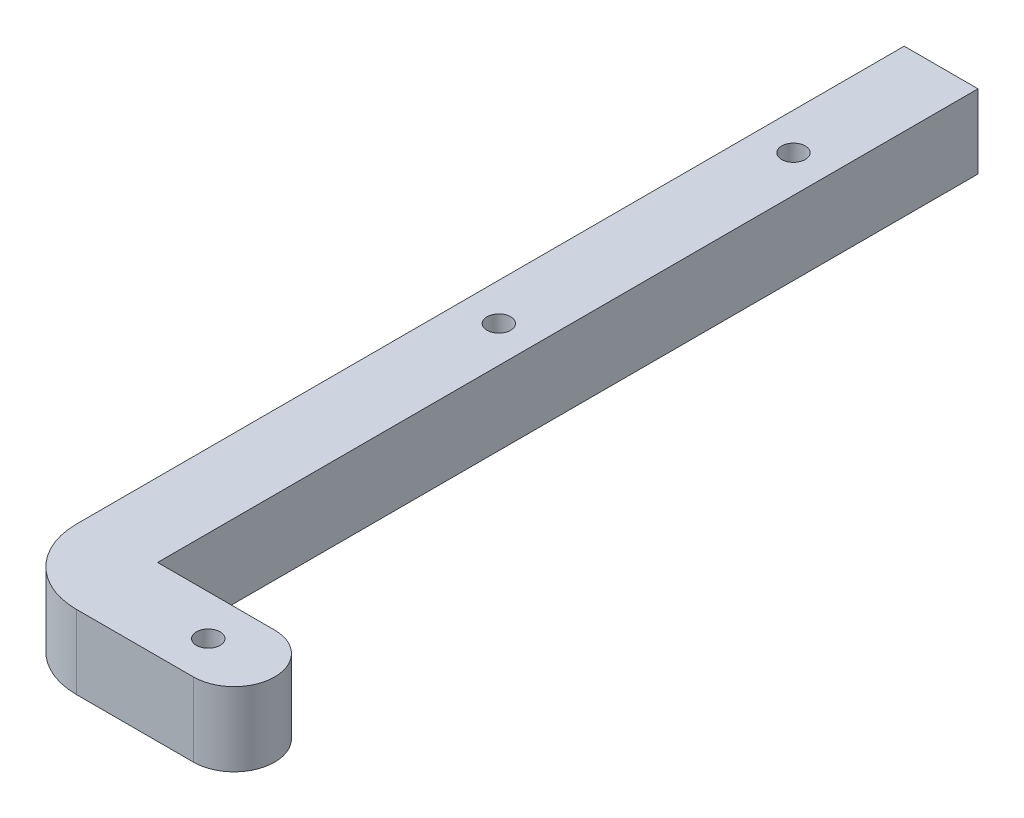
ISO-10303-21;
HEADER;
FILE_DESCRIPTION(('STEP AP214'),'2;1');
FILE_NAME('part.step','',(''),(''),'','','');
FILE_SCHEMA(('AUTOMOTIVE_DESIGN { 1 0 10303 214 1 1 1 1 }'));
ENDSEC;
DATA;
#1=APPLICATION_CONTEXT('core data for automotive mechanical design processes');
#2=APPLICATION_PROTOCOL_DEFINITION('international standard','automotive_design',2000,#1);
#3=PRODUCT_CONTEXT('',#1,'mechanical');
#4=PRODUCT('Part','Part','',(#3));
#5=PRODUCT_RELATED_PRODUCT_CATEGORY('part','',(#4));
#6=PRODUCT_DEFINITION_FORMATION('','',#4);
#7=PRODUCT_DEFINITION_CONTEXT('part definition',#1,'design');
#8=PRODUCT_DEFINITION('design','',#6,#7);
#9=PRODUCT_DEFINITION_SHAPE('','',#8);
#10=(LENGTH_UNIT() NAMED_UNIT(*) SI_UNIT(.MILLI.,.METRE.));
#11=(NAMED_UNIT(*) PLANE_ANGLE_UNIT() SI_UNIT($,.RADIAN.));
#12=(NAMED_UNIT(*) SI_UNIT($,.STERADIAN.) SOLID_ANGLE_UNIT());
#13=UNCERTAINTY_MEASURE_WITH_UNIT(LENGTH_MEASURE(1.E-05),#10,'distance_accuracy_value','');
#14=(GEOMETRIC_REPRESENTATION_CONTEXT(3) GLOBAL_UNCERTAINTY_ASSIGNED_CONTEXT((#13)) GLOBAL_UNIT_ASSIGNED_CONTEXT((#10,
#11,#12)) REPRESENTATION_CONTEXT('',''));
#15=CARTESIAN_POINT('',(0.,0.,0.));
#16=DIRECTION('',(0.,0.,1.));
#17=DIRECTION('',(1.,0.,0.));
#18=AXIS2_PLACEMENT_3D('',#15,#16,#17);
#19=CARTESIAN_POINT('',(-58.1403577183255,10.,6.78590490324844));
#20=DIRECTION('',(1.,0.,0.));
#21=DIRECTION('',(0.,0.,-1.));
#22=AXIS2_PLACEMENT_3D('',#19,#20,#21);
#23=PLANE('',#22);
#24=DIRECTION('',(0.,0.,1.));
#25=VECTOR('',#24,1.);
#26=CARTESIAN_POINT('',(-58.1403577183255,0.,6.78590490324844));
#27=LINE('',#26,#25);
#28=CARTESIAN_POINT('',(-58.1403577183256,0.,-104.367316492916));
#29=VERTEX_POINT('',#28);
#30=CARTESIAN_POINT('',(-58.1403577183255,0.,7.78590490324844));
#31=VERTEX_POINT('',#30);
#32=EDGE_CURVE('E137',#29,#31,#27,.T.);
#33=ORIENTED_EDGE('',*,*,#32,.T.);
#34=DIRECTION('',(0.,-1.,0.));
#35=VECTOR('',#34,1.);
#36=CARTESIAN_POINT('',(-58.1403577183255,10.,7.78590490324844));
#37=LINE('',#36,#35);
#38=CARTESIAN_POINT('',(-58.1403577183255,10.,7.78590490324842));
#39=VERTEX_POINT('',#38);
#40=EDGE_CURVE('E48',#31,#39,#37,.F.);
#41=ORIENTED_EDGE('',*,*,#40,.T.);
#42=DIRECTION('',(0.,0.,1.));
#43=VECTOR('',#42,1.);
#44=CARTESIAN_POINT('',(-58.1403577183256,10.,-104.367316492916));
#45=LINE('',#44,#43);
#46=CARTESIAN_POINT('',(-58.1403577183256,10.,-104.367316492916));
#47=VERTEX_POINT('',#46);
#48=EDGE_CURVE('E108',#47,#39,#45,.T.);
#49=ORIENTED_EDGE('',*,*,#48,.F.);
#50=DIRECTION('',(0.,-1.,0.));
#51=VECTOR('',#50,1.);
#52=CARTESIAN_POINT('',(-58.1403577183256,10.,-104.367316492916));
#53=LINE('',#52,#51);
#54=EDGE_CURVE('E136',#47,#29,#53,.T.);
#55=ORIENTED_EDGE('',*,*,#54,.T.);
#56=EDGE_LOOP('',(#33,#41,#49,#55));
#57=FACE_BOUND('',#56,.T.);
#58=ADVANCED_FACE('F39',(#57),#23,.F.);
#59=CARTESIAN_POINT('',(-58.1403577183255,10.,17.7859049032484));
#60=DIRECTION('',(0.,0.,-1.));
#61=DIRECTION('',(-1.,0.,0.));
#62=AXIS2_PLACEMENT_3D('',#59,#60,#61);
#63=PLANE('',#62);
#64=DIRECTION('',(1.,0.,0.));
#65=VECTOR('',#64,1.);
#66=CARTESIAN_POINT('',(-58.1403577183255,10.,17.7859049032484));
#67=LINE('',#66,#65);
#68=CARTESIAN_POINT('',(-48.1403577183255,10.,17.7859049032484));
#69=VERTEX_POINT('',#68);
#70=CARTESIAN_POINT('',(-32.2755837842111,10.,17.7859049032484));
#71=VERTEX_POINT('',#70);
#72=EDGE_CURVE('E97',#69,#71,#67,.T.);
#73=ORIENTED_EDGE('',*,*,#72,.F.);
#74=DIRECTION('',(0.,-1.,0.));
#75=VECTOR('',#74,1.);
#76=CARTESIAN_POINT('',(-48.1403577183255,10.,17.7859049032484));
#77=LINE('',#76,#75);
#78=CARTESIAN_POINT('',(-48.1403577183255,0.,17.7859049032484));
#79=VERTEX_POINT('',#78);
#80=EDGE_CURVE('E117',#69,#79,#77,.T.);
#81=ORIENTED_EDGE('',*,*,#80,.T.);
#82=DIRECTION('',(1.,0.,0.));
#83=VECTOR('',#82,1.);
#84=CARTESIAN_POINT('',(-58.1403577183255,0.,17.7859049032484));
#85=LINE('',#84,#83);
#86=CARTESIAN_POINT('',(-32.2755837842111,0.,17.7859049032484));
#87=VERTEX_POINT('',#86);
#88=EDGE_CURVE('E113',#79,#87,#85,.T.);
#89=ORIENTED_EDGE('',*,*,#88,.T.);
#90=DIRECTION('',(0.,-1.,0.));
#91=VECTOR('',#90,1.);
#92=CARTESIAN_POINT('',(-32.2755837842111,10.,17.7859049032484));
#93=LINE('',#92,#91);
#94=EDGE_CURVE('E111',#71,#87,#93,.T.);
#95=ORIENTED_EDGE('',*,*,#94,.F.);
#96=EDGE_LOOP('',(#73,#81,#89,#95));
#97=FACE_BOUND('',#96,.T.);
#98=ADVANCED_FACE('F112',(#97),#63,.F.);
#99=CARTESIAN_POINT('',(-32.2755837842111,10.,12.2859049032484));
#100=DIRECTION('',(0.,-1.,0.));
#101=DIRECTION('',(0.,0.,-1.));
#102=AXIS2_PLACEMENT_3D('',#99,#100,#101);
#103=CYLINDRICAL_SURFACE('',#102,5.5);
#104=CARTESIAN_POINT('',(-32.2755837842111,0.,12.2859049032484));
#105=DIRECTION('',(0.,1.,0.));
#106=DIRECTION('',(0.,0.,1.));
#107=AXIS2_PLACEMENT_3D('',#104,#105,#106);
#108=CIRCLE('',#107,5.5);
#109=CARTESIAN_POINT('',(-32.2755837842111,0.,6.78590490324844));
#110=VERTEX_POINT('',#109);
#111=EDGE_CURVE('E143',#87,#110,#108,.T.);
#112=ORIENTED_EDGE('',*,*,#111,.T.);
#113=DIRECTION('',(0.,-1.,0.));
#114=VECTOR('',#113,1.);
#115=CARTESIAN_POINT('',(-32.2755837842111,10.,6.78590490324844));
#116=LINE('',#115,#114);
#117=CARTESIAN_POINT('',(-32.2755837842111,10.,6.78590490324844));
#118=VERTEX_POINT('',#117);
#119=EDGE_CURVE('E118',#118,#110,#116,.T.);
#120=ORIENTED_EDGE('',*,*,#119,.F.);
#121=CARTESIAN_POINT('',(-32.2755837842111,10.,12.2859049032484));
#122=DIRECTION('',(0.,1.,0.));
#123=DIRECTION('',(0.,0.,1.));
#124=AXIS2_PLACEMENT_3D('',#121,#122,#123);
#125=CIRCLE('',#124,5.5);
#126=EDGE_CURVE('E101',#71,#118,#125,.T.);
#127=ORIENTED_EDGE('',*,*,#126,.F.);
#128=ORIENTED_EDGE('',*,*,#94,.T.);
#129=EDGE_LOOP('',(#112,#120,#127,#128));
#130=FACE_BOUND('',#129,.T.);
#131=ADVANCED_FACE('F120',(#130),#103,.T.);
#132=CARTESIAN_POINT('',(-48.1403577183255,10.,6.78590490324844));
#133=DIRECTION('',(0.,0.,1.));
#134=DIRECTION('',(1.,0.,0.));
#135=AXIS2_PLACEMENT_3D('',#132,#133,#134);
#136=PLANE('',#135);
#137=DIRECTION('',(-1.,0.,0.));
#138=VECTOR('',#137,1.);
#139=CARTESIAN_POINT('',(-48.1403577183255,0.,6.78590490324844));
#140=LINE('',#139,#138);
#141=CARTESIAN_POINT('',(-48.1403577183255,0.,6.78590490324844));
#142=VERTEX_POINT('',#141);
#143=EDGE_CURVE('E146',#110,#142,#140,.T.);
#144=ORIENTED_EDGE('',*,*,#143,.T.);
#145=DIRECTION('',(0.,-1.,0.));
#146=VECTOR('',#145,1.);
#147=CARTESIAN_POINT('',(-48.1403577183255,10.,6.78590490324844));
#148=LINE('',#147,#146);
#149=CARTESIAN_POINT('',(-48.1403577183255,10.,6.78590490324844));
#150=VERTEX_POINT('',#149);
#151=EDGE_CURVE('E163',#150,#142,#148,.T.);
#152=ORIENTED_EDGE('',*,*,#151,.F.);
#153=DIRECTION('',(-1.,0.,0.));
#154=VECTOR('',#153,1.);
#155=CARTESIAN_POINT('',(-48.1403577183255,10.,6.78590490324844));
#156=LINE('',#155,#154);
#157=EDGE_CURVE('E124',#118,#150,#156,.T.);
#158=ORIENTED_EDGE('',*,*,#157,.F.);
#159=ORIENTED_EDGE('',*,*,#119,.T.);
#160=EDGE_LOOP('',(#144,#152,#158,#159));
#161=FACE_BOUND('',#160,.T.);
#162=ADVANCED_FACE('F178',(#161),#136,.F.);
#163=CARTESIAN_POINT('',(-48.1403577183256,10.,-104.367316492916));
#164=DIRECTION('',(-1.,0.,0.));
#165=DIRECTION('',(0.,0.,1.));
#166=AXIS2_PLACEMENT_3D('',#163,#164,#165);
#167=PLANE('',#166);
#168=DIRECTION('',(0.,0.,-1.));
#169=VECTOR('',#168,1.);
#170=CARTESIAN_POINT('',(-48.1403577183256,0.,-104.367316492916));
#171=LINE('',#170,#169);
#172=CARTESIAN_POINT('',(-48.1403577183256,0.,-104.367316492916));
#173=VERTEX_POINT('',#172);
#174=EDGE_CURVE('E149',#142,#173,#171,.T.);
#175=ORIENTED_EDGE('',*,*,#174,.T.);
#176=DIRECTION('',(0.,-1.,0.));
#177=VECTOR('',#176,1.);
#178=CARTESIAN_POINT('',(-48.1403577183256,10.,-104.367316492916));
#179=LINE('',#178,#177);
#180=CARTESIAN_POINT('',(-48.1403577183256,10.,-104.367316492916));
#181=VERTEX_POINT('',#180);
#182=EDGE_CURVE('E159',#181,#173,#179,.T.);
#183=ORIENTED_EDGE('',*,*,#182,.F.);
#184=DIRECTION('',(0.,0.,-1.));
#185=VECTOR('',#184,1.);
#186=CARTESIAN_POINT('',(-48.1403577183256,10.,-104.367316492916));
#187=LINE('',#186,#185);
#188=EDGE_CURVE('E127',#150,#181,#187,.T.);
#189=ORIENTED_EDGE('',*,*,#188,.F.);
#190=ORIENTED_EDGE('',*,*,#151,.T.);
#191=EDGE_LOOP('',(#175,#183,#189,#190));
#192=FACE_BOUND('',#191,.T.);
#193=ADVANCED_FACE('F185',(#192),#167,.F.);
#194=CARTESIAN_POINT('',(-58.1403577183256,10.,-104.367316492916));
#195=DIRECTION('',(0.,0.,1.));
#196=DIRECTION('',(1.,0.,0.));
#197=AXIS2_PLACEMENT_3D('',#194,#195,#196);
#198=PLANE('',#197);
#199=DIRECTION('',(-1.,0.,0.));
#200=VECTOR('',#199,1.);
#201=CARTESIAN_POINT('',(-58.1403577183256,0.,-104.367316492916));
#202=LINE('',#201,#200);
#203=EDGE_CURVE('E152',#173,#29,#202,.T.);
#204=ORIENTED_EDGE('',*,*,#203,.T.);
#205=ORIENTED_EDGE('',*,*,#54,.F.);
#206=DIRECTION('',(-1.,0.,0.));
#207=VECTOR('',#206,1.);
#208=CARTESIAN_POINT('',(-58.1403577183256,10.,-104.367316492916));
#209=LINE('',#208,#207);
#210=EDGE_CURVE('E133',#181,#47,#209,.T.);
#211=ORIENTED_EDGE('',*,*,#210,.F.);
#212=ORIENTED_EDGE('',*,*,#182,.T.);
#213=EDGE_LOOP('',(#204,#205,#211,#212));
#214=FACE_BOUND('',#213,.T.);
#215=ADVANCED_FACE('F188',(#214),#198,.F.);
#216=CARTESIAN_POINT('',(-32.2755837842111,10.,12.2859049032484));
#217=DIRECTION('',(0.,1.,0.));
#218=DIRECTION('',(0.,0.,1.));
#219=AXIS2_PLACEMENT_3D('',#216,#217,#218);
#220=PLANE('',#219);
#221=CARTESIAN_POINT('',(-35.7755837842111,10.,12.2859049032484));
#222=DIRECTION('',(0.,-1.,0.));
#223=DIRECTION('',(0.,0.,-1.));
#224=AXIS2_PLACEMENT_3D('',#221,#222,#223);
#225=CIRCLE('',#224,1.6);
#226=CARTESIAN_POINT('',(-35.7755837842111,10.,10.6859049032484));
#227=VERTEX_POINT('',#226);
#228=EDGE_CURVE('E206',#227,#227,#225,.T.);
#229=ORIENTED_EDGE('',*,*,#228,.T.);
#230=EDGE_LOOP('',(#229));
#231=FACE_BOUND('',#230,.T.);
#232=CARTESIAN_POINT('',(-53.1403577183256,10.,-84.3673164929159));
#233=DIRECTION('',(0.,-1.,0.));
#234=DIRECTION('',(0.,0.,-1.));
#235=AXIS2_PLACEMENT_3D('',#232,#233,#234);
#236=CIRCLE('',#235,1.6);
#237=CARTESIAN_POINT('',(-53.1403577183256,10.,-85.9673164929159));
#238=VERTEX_POINT('',#237);
#239=EDGE_CURVE('E198',#238,#238,#236,.T.);
#240=ORIENTED_EDGE('',*,*,#239,.T.);
#241=EDGE_LOOP('',(#240));
#242=FACE_BOUND('',#241,.T.);
#243=CARTESIAN_POINT('',(-53.0597175532663,10.,-44.3673977784512));
#244=DIRECTION('',(0.,-1.,0.));
#245=DIRECTION('',(0.,0.,-1.));
#246=AXIS2_PLACEMENT_3D('',#243,#244,#245);
#247=CIRCLE('',#246,1.6);
#248=CARTESIAN_POINT('',(-53.0597175532663,10.,-45.9673977784513));
#249=VERTEX_POINT('',#248);
#250=EDGE_CURVE('E140',#249,#249,#247,.T.);
#251=ORIENTED_EDGE('',*,*,#250,.T.);
#252=EDGE_LOOP('',(#251));
#253=FACE_BOUND('',#252,.T.);
#254=ORIENTED_EDGE('',*,*,#48,.T.);
#255=CARTESIAN_POINT('',(-48.1403577183255,10.,7.78590490324844));
#256=DIRECTION('',(0.,1.,0.));
#257=DIRECTION('',(0.,0.,1.));
#258=AXIS2_PLACEMENT_3D('',#255,#256,#257);
#259=CIRCLE('',#258,10.);
#260=EDGE_CURVE('E11',#39,#69,#259,.T.);
#261=ORIENTED_EDGE('',*,*,#260,.T.);
#262=ORIENTED_EDGE('',*,*,#72,.T.);
#263=ORIENTED_EDGE('',*,*,#126,.T.);
#264=ORIENTED_EDGE('',*,*,#157,.T.);
#265=ORIENTED_EDGE('',*,*,#188,.T.);
#266=ORIENTED_EDGE('',*,*,#210,.T.);
#267=EDGE_LOOP('',(#254,#261,#262,#263,#264,#265,#266));
#268=FACE_BOUND('',#267,.T.);
#269=ADVANCED_FACE('F99',(#231,#242,#253,#268),#220,.T.);
#270=CARTESIAN_POINT('',(-32.2755837842111,0.,12.2859049032484));
#271=DIRECTION('',(0.,1.,0.));
#272=DIRECTION('',(0.,0.,1.));
#273=AXIS2_PLACEMENT_3D('',#270,#271,#272);
#274=PLANE('',#273);
#275=CARTESIAN_POINT('',(-35.7755837842111,0.,12.2859049032484));
#276=DIRECTION('',(0.,-1.,0.));
#277=DIRECTION('',(0.,0.,-1.));
#278=AXIS2_PLACEMENT_3D('',#275,#276,#277);
#279=CIRCLE('',#278,1.59999999999999);
#280=CARTESIAN_POINT('',(-35.7755837842111,0.,10.6859049032484));
#281=VERTEX_POINT('',#280);
#282=EDGE_CURVE('E210',#281,#281,#279,.T.);
#283=ORIENTED_EDGE('',*,*,#282,.F.);
#284=EDGE_LOOP('',(#283));
#285=FACE_BOUND('',#284,.T.);
#286=CARTESIAN_POINT('',(-53.1403577183256,0.,-84.3673164929159));
#287=DIRECTION('',(0.,-1.,0.));
#288=DIRECTION('',(0.,0.,-1.));
#289=AXIS2_PLACEMENT_3D('',#286,#287,#288);
#290=CIRCLE('',#289,1.59999999999998);
#291=CARTESIAN_POINT('',(-53.1403577183256,0.,-85.9673164929159));
#292=VERTEX_POINT('',#291);
#293=EDGE_CURVE('E202',#292,#292,#290,.T.);
#294=ORIENTED_EDGE('',*,*,#293,.F.);
#295=EDGE_LOOP('',(#294));
#296=FACE_BOUND('',#295,.T.);
#297=CARTESIAN_POINT('',(-53.0597175532663,0.,-44.3673977784512));
#298=DIRECTION('',(0.,-1.,0.));
#299=DIRECTION('',(0.,0.,-1.));
#300=AXIS2_PLACEMENT_3D('',#297,#298,#299);
#301=CIRCLE('',#300,1.59999999999998);
#302=CARTESIAN_POINT('',(-53.0597175532663,0.,-45.9673977784512));
#303=VERTEX_POINT('',#302);
#304=EDGE_CURVE('E194',#303,#303,#301,.T.);
#305=ORIENTED_EDGE('',*,*,#304,.F.);
#306=EDGE_LOOP('',(#305));
#307=FACE_BOUND('',#306,.T.);
#308=ORIENTED_EDGE('',*,*,#88,.F.);
#309=CARTESIAN_POINT('',(-48.1403577183255,0.,7.78590490324844));
#310=DIRECTION('',(0.,1.,0.));
#311=DIRECTION('',(0.,0.,1.));
#312=AXIS2_PLACEMENT_3D('',#309,#310,#311);
#313=CIRCLE('',#312,10.);
#314=EDGE_CURVE('E62',#79,#31,#313,.F.);
#315=ORIENTED_EDGE('',*,*,#314,.T.);
#316=ORIENTED_EDGE('',*,*,#32,.F.);
#317=ORIENTED_EDGE('',*,*,#203,.F.);
#318=ORIENTED_EDGE('',*,*,#174,.F.);
#319=ORIENTED_EDGE('',*,*,#143,.F.);
#320=ORIENTED_EDGE('',*,*,#111,.F.);
#321=EDGE_LOOP('',(#308,#315,#316,#317,#318,#319,#320));
#322=FACE_BOUND('',#321,.T.);
#323=ADVANCED_FACE('F174',(#285,#296,#307,#322),#274,.F.);
#324=CARTESIAN_POINT('',(-48.1403577183255,10.,7.78590490324844));
#325=DIRECTION('',(0.,-1.,0.));
#326=DIRECTION('',(0.,0.,-1.));
#327=AXIS2_PLACEMENT_3D('',#324,#325,#326);
#328=CYLINDRICAL_SURFACE('',#327,10.);
#329=ORIENTED_EDGE('',*,*,#260,.F.);
#330=ORIENTED_EDGE('',*,*,#40,.F.);
#331=ORIENTED_EDGE('',*,*,#314,.F.);
#332=ORIENTED_EDGE('',*,*,#80,.F.);
#333=EDGE_LOOP('',(#329,#330,#331,#332));
#334=FACE_BOUND('',#333,.T.);
#335=ADVANCED_FACE('F41',(#334),#328,.T.);
#336=CARTESIAN_POINT('',(-53.0597175532663,0.,-44.3673977784512));
#337=DIRECTION('',(0.,-1.,0.));
#338=DIRECTION('',(0.,0.,-1.));
#339=AXIS2_PLACEMENT_3D('',#336,#337,#338);
#340=CYLINDRICAL_SURFACE('',#339,1.59999999999999);
#341=ORIENTED_EDGE('',*,*,#250,.F.);
#342=EDGE_LOOP('',(#341));
#343=FACE_BOUND('',#342,.T.);
#344=ORIENTED_EDGE('',*,*,#304,.T.);
#345=EDGE_LOOP('',(#344));
#346=FACE_BOUND('',#345,.T.);
#347=ADVANCED_FACE('F224',(#343,#346),#340,.F.);
#348=CARTESIAN_POINT('',(-53.1403577183256,0.,-84.3673164929159));
#349=DIRECTION('',(0.,-1.,0.));
#350=DIRECTION('',(0.,0.,-1.));
#351=AXIS2_PLACEMENT_3D('',#348,#349,#350);
#352=CYLINDRICAL_SURFACE('',#351,1.59999999999999);
#353=ORIENTED_EDGE('',*,*,#239,.F.);
#354=EDGE_LOOP('',(#353));
#355=FACE_BOUND('',#354,.T.);
#356=ORIENTED_EDGE('',*,*,#293,.T.);
#357=EDGE_LOOP('',(#356));
#358=FACE_BOUND('',#357,.T.);
#359=ADVANCED_FACE('F226',(#355,#358),#352,.F.);
#360=CARTESIAN_POINT('',(-35.7755837842111,0.,12.2859049032484));
#361=DIRECTION('',(0.,-1.,0.));
#362=DIRECTION('',(0.,0.,-1.));
#363=AXIS2_PLACEMENT_3D('',#360,#361,#362);
#364=CYLINDRICAL_SURFACE('',#363,1.59999999999999);
#365=ORIENTED_EDGE('',*,*,#228,.F.);
#366=EDGE_LOOP('',(#365));
#367=FACE_BOUND('',#366,.T.);
#368=ORIENTED_EDGE('',*,*,#282,.T.);
#369=EDGE_LOOP('',(#368));
#370=FACE_BOUND('',#369,.T.);
#371=ADVANCED_FACE('F215',(#367,#370),#364,.F.);
#372=CLOSED_SHELL('',(#58,#98,#131,#162,#193,#215,#269,#323,#335,#347,#359,#371));
#373=MANIFOLD_SOLID_BREP('B2',#372);
#374=ADVANCED_BREP_SHAPE_REPRESENTATION('',(#18,#373),#14);
#375=SHAPE_DEFINITION_REPRESENTATION(#9,#374);
ENDSEC;
END-ISO-10303-21;
